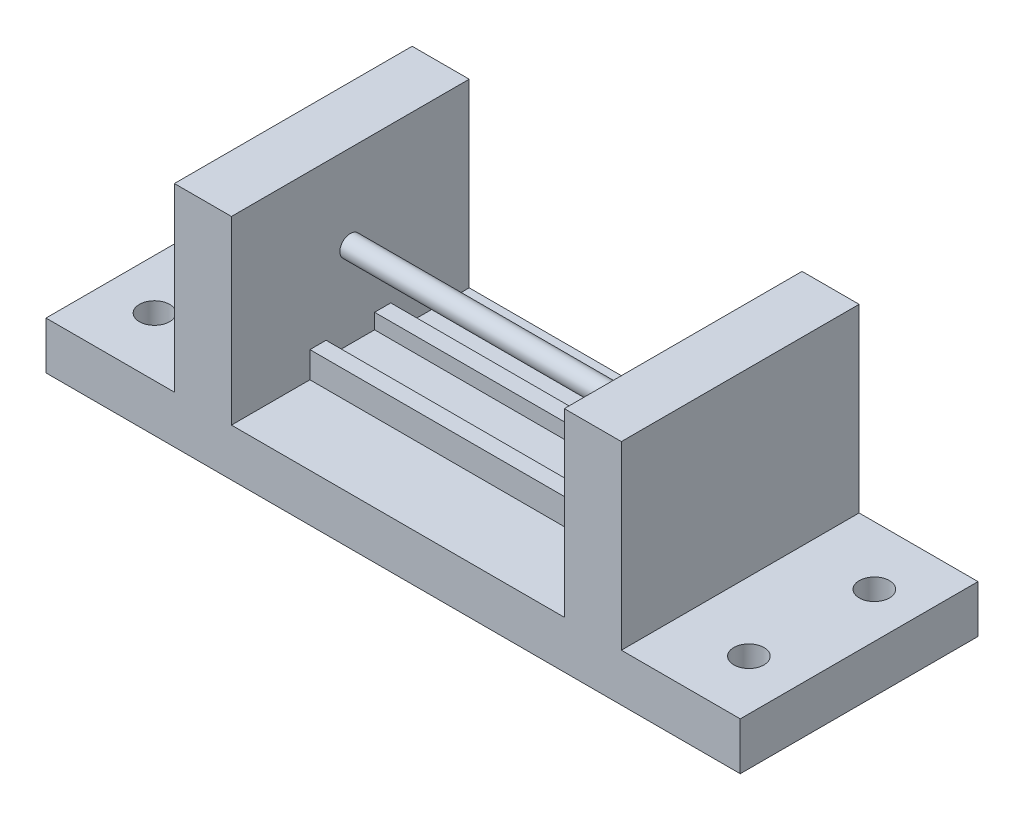
ISO-10303-21;
HEADER;
FILE_DESCRIPTION(('STEP AP214'),'2;1');
FILE_NAME('part.step','',(''),(''),'','','');
FILE_SCHEMA(('AUTOMOTIVE_DESIGN { 1 0 10303 214 1 1 1 1 }'));
ENDSEC;
DATA;
#1=APPLICATION_CONTEXT('core data for automotive mechanical design processes');
#2=APPLICATION_PROTOCOL_DEFINITION('international standard','automotive_design',2000,#1);
#3=PRODUCT_CONTEXT('',#1,'mechanical');
#4=PRODUCT('Part','Part','',(#3));
#5=PRODUCT_RELATED_PRODUCT_CATEGORY('part','',(#4));
#6=PRODUCT_DEFINITION_FORMATION('','',#4);
#7=PRODUCT_DEFINITION_CONTEXT('part definition',#1,'design');
#8=PRODUCT_DEFINITION('design','',#6,#7);
#9=PRODUCT_DEFINITION_SHAPE('','',#8);
#10=(LENGTH_UNIT() NAMED_UNIT(*) SI_UNIT(.MILLI.,.METRE.));
#11=(NAMED_UNIT(*) PLANE_ANGLE_UNIT() SI_UNIT($,.RADIAN.));
#12=(NAMED_UNIT(*) SI_UNIT($,.STERADIAN.) SOLID_ANGLE_UNIT());
#13=UNCERTAINTY_MEASURE_WITH_UNIT(LENGTH_MEASURE(1.E-05),#10,'distance_accuracy_value','');
#14=(GEOMETRIC_REPRESENTATION_CONTEXT(3) GLOBAL_UNCERTAINTY_ASSIGNED_CONTEXT((#13)) GLOBAL_UNIT_ASSIGNED_CONTEXT((#10,
#11,#12)) REPRESENTATION_CONTEXT('',''));
#15=CARTESIAN_POINT('',(0.,0.,0.));
#16=DIRECTION('',(0.,0.,1.));
#17=DIRECTION('',(1.,0.,0.));
#18=AXIS2_PLACEMENT_3D('',#15,#16,#17);
#19=CARTESIAN_POINT('',(0.,15.5,0.));
#20=DIRECTION('',(0.,-1.,0.));
#21=DIRECTION('',(0.,0.,-1.));
#22=AXIS2_PLACEMENT_3D('',#19,#20,#21);
#23=PLANE('',#22);
#24=DIRECTION('',(0.,0.,1.));
#25=VECTOR('',#24,1.);
#26=CARTESIAN_POINT('',(39.,15.5,33.5));
#27=LINE('',#26,#25);
#28=CARTESIAN_POINT('',(39.,15.5,16.5));
#29=VERTEX_POINT('',#28);
#30=CARTESIAN_POINT('',(39.,15.5,19.9));
#31=VERTEX_POINT('',#30);
#32=EDGE_CURVE('E210',#29,#31,#27,.T.);
#33=ORIENTED_EDGE('',*,*,#32,.T.);
#34=DIRECTION('',(-1.,0.,0.));
#35=VECTOR('',#34,1.);
#36=CARTESIAN_POINT('',(39.,15.5,19.9));
#37=LINE('',#36,#35);
#38=CARTESIAN_POINT('',(109.,15.5,19.9));
#39=VERTEX_POINT('',#38);
#40=EDGE_CURVE('E49',#39,#31,#37,.T.);
#41=ORIENTED_EDGE('',*,*,#40,.F.);
#42=DIRECTION('',(0.,0.,-1.));
#43=VECTOR('',#42,1.);
#44=CARTESIAN_POINT('',(109.,15.5,16.5));
#45=LINE('',#44,#43);
#46=CARTESIAN_POINT('',(109.,15.5,16.5));
#47=VERTEX_POINT('',#46);
#48=EDGE_CURVE('E56',#39,#47,#45,.T.);
#49=ORIENTED_EDGE('',*,*,#48,.T.);
#50=DIRECTION('',(-1.,0.,0.));
#51=VECTOR('',#50,1.);
#52=CARTESIAN_POINT('',(39.,15.5,16.5));
#53=LINE('',#52,#51);
#54=EDGE_CURVE('E206',#47,#29,#53,.T.);
#55=ORIENTED_EDGE('',*,*,#54,.T.);
#56=EDGE_LOOP('',(#33,#41,#49,#55));
#57=FACE_BOUND('',#56,.T.);
#58=ADVANCED_FACE('F34',(#57),#23,.F.);
#59=CARTESIAN_POINT('',(0.,10.,0.));
#60=DIRECTION('',(0.,1.,0.));
#61=DIRECTION('',(0.,0.,1.));
#62=AXIS2_PLACEMENT_3D('',#59,#60,#61);
#63=PLANE('',#62);
#64=DIRECTION('',(0.,0.,-1.));
#65=VECTOR('',#64,1.);
#66=CARTESIAN_POINT('',(39.,10.,0.));
#67=LINE('',#66,#65);
#68=CARTESIAN_POINT('',(39.,10.,16.5));
#69=VERTEX_POINT('',#68);
#70=CARTESIAN_POINT('',(39.,10.,0.));
#71=VERTEX_POINT('',#70);
#72=EDGE_CURVE('E252',#69,#71,#67,.T.);
#73=ORIENTED_EDGE('',*,*,#72,.F.);
#74=DIRECTION('',(-1.,0.,0.));
#75=VECTOR('',#74,1.);
#76=CARTESIAN_POINT('',(39.,10.,16.5));
#77=LINE('',#76,#75);
#78=CARTESIAN_POINT('',(109.,10.,16.5));
#79=VERTEX_POINT('',#78);
#80=EDGE_CURVE('E202',#79,#69,#77,.T.);
#81=ORIENTED_EDGE('',*,*,#80,.F.);
#82=DIRECTION('',(0.,0.,1.));
#83=VECTOR('',#82,1.);
#84=CARTESIAN_POINT('',(109.,10.,0.));
#85=LINE('',#84,#83);
#86=CARTESIAN_POINT('',(109.,10.,0.));
#87=VERTEX_POINT('',#86);
#88=EDGE_CURVE('E271',#87,#79,#85,.T.);
#89=ORIENTED_EDGE('',*,*,#88,.F.);
#90=DIRECTION('',(-1.,0.,0.));
#91=VECTOR('',#90,1.);
#92=CARTESIAN_POINT('',(0.,10.,0.));
#93=LINE('',#92,#91);
#94=EDGE_CURVE('E333',#87,#71,#93,.T.);
#95=ORIENTED_EDGE('',*,*,#94,.T.);
#96=EDGE_LOOP('',(#73,#81,#89,#95));
#97=FACE_BOUND('',#96,.T.);
#98=ADVANCED_FACE('F373',(#97),#63,.T.);
#99=CARTESIAN_POINT('',(109.,10.,33.5));
#100=VERTEX_POINT('',#99);
#101=CARTESIAN_POINT('',(109.,10.,50.));
#102=VERTEX_POINT('',#101);
#103=EDGE_CURVE('E280',#100,#102,#85,.T.);
#104=ORIENTED_EDGE('',*,*,#103,.F.);
#105=DIRECTION('',(1.,0.,0.));
#106=VECTOR('',#105,1.);
#107=CARTESIAN_POINT('',(109.,10.,33.5));
#108=LINE('',#107,#106);
#109=CARTESIAN_POINT('',(39.,10.,33.5));
#110=VERTEX_POINT('',#109);
#111=EDGE_CURVE('E209',#110,#100,#108,.T.);
#112=ORIENTED_EDGE('',*,*,#111,.F.);
#113=CARTESIAN_POINT('',(39.,10.,50.));
#114=VERTEX_POINT('',#113);
#115=EDGE_CURVE('E243',#114,#110,#67,.T.);
#116=ORIENTED_EDGE('',*,*,#115,.F.);
#117=DIRECTION('',(1.,0.,0.));
#118=VECTOR('',#117,1.);
#119=CARTESIAN_POINT('',(0.,10.,50.));
#120=LINE('',#119,#118);
#121=EDGE_CURVE('E327',#114,#102,#120,.T.);
#122=ORIENTED_EDGE('',*,*,#121,.T.);
#123=EDGE_LOOP('',(#104,#112,#116,#122));
#124=FACE_BOUND('',#123,.T.);
#125=ADVANCED_FACE('F402',(#124),#63,.T.);
#126=CARTESIAN_POINT('',(109.,48.,0.));
#127=DIRECTION('',(1.,0.,0.));
#128=DIRECTION('',(0.,0.,-1.));
#129=AXIS2_PLACEMENT_3D('',#126,#127,#128);
#130=PLANE('',#129);
#131=CARTESIAN_POINT('',(109.,30.2,25.));
#132=DIRECTION('',(1.,0.,0.));
#133=DIRECTION('',(0.,0.,-1.));
#134=AXIS2_PLACEMENT_3D('',#131,#132,#133);
#135=CIRCLE('',#134,2.2);
#136=CARTESIAN_POINT('',(109.,30.2,22.8));
#137=VERTEX_POINT('',#136);
#138=EDGE_CURVE('E235',#137,#137,#135,.T.);
#139=ORIENTED_EDGE('',*,*,#138,.T.);
#140=EDGE_LOOP('',(#139));
#141=FACE_BOUND('',#140,.T.);
#142=DIRECTION('',(0.,-1.,0.));
#143=VECTOR('',#142,1.);
#144=CARTESIAN_POINT('',(109.,15.5,16.5));
#145=LINE('',#144,#143);
#146=EDGE_CURVE('E218',#47,#79,#145,.T.);
#147=ORIENTED_EDGE('',*,*,#146,.F.);
#148=ORIENTED_EDGE('',*,*,#48,.F.);
#149=DIRECTION('',(0.,1.,0.));
#150=VECTOR('',#149,1.);
#151=CARTESIAN_POINT('',(109.,12.3,19.9));
#152=LINE('',#151,#150);
#153=CARTESIAN_POINT('',(109.,12.3,19.9));
#154=VERTEX_POINT('',#153);
#155=EDGE_CURVE('E200',#154,#39,#152,.T.);
#156=ORIENTED_EDGE('',*,*,#155,.F.);
#157=DIRECTION('',(0.,0.,-1.));
#158=VECTOR('',#157,1.);
#159=CARTESIAN_POINT('',(109.,12.3,19.9));
#160=LINE('',#159,#158);
#161=CARTESIAN_POINT('',(109.,12.3,30.0999999999999));
#162=VERTEX_POINT('',#161);
#163=EDGE_CURVE('E179',#162,#154,#160,.T.);
#164=ORIENTED_EDGE('',*,*,#163,.F.);
#165=DIRECTION('',(0.,1.,0.));
#166=VECTOR('',#165,1.);
#167=CARTESIAN_POINT('',(109.,12.3,30.0999999999999));
#168=LINE('',#167,#166);
#169=CARTESIAN_POINT('',(109.,15.5,30.0999999999999));
#170=VERTEX_POINT('',#169);
#171=EDGE_CURVE('E203',#162,#170,#168,.T.);
#172=ORIENTED_EDGE('',*,*,#171,.T.);
#173=CARTESIAN_POINT('',(109.,15.5,33.5));
#174=VERTEX_POINT('',#173);
#175=EDGE_CURVE('E215',#174,#170,#45,.T.);
#176=ORIENTED_EDGE('',*,*,#175,.F.);
#177=DIRECTION('',(0.,-1.,0.));
#178=VECTOR('',#177,1.);
#179=CARTESIAN_POINT('',(109.,15.5,33.5));
#180=LINE('',#179,#178);
#181=EDGE_CURVE('E225',#174,#100,#180,.T.);
#182=ORIENTED_EDGE('',*,*,#181,.T.);
#183=ORIENTED_EDGE('',*,*,#103,.T.);
#184=DIRECTION('',(0.,-1.,0.));
#185=VECTOR('',#184,1.);
#186=CARTESIAN_POINT('',(109.,48.,50.));
#187=LINE('',#186,#185);
#188=CARTESIAN_POINT('',(109.,48.,50.));
#189=VERTEX_POINT('',#188);
#190=EDGE_CURVE('E285',#189,#102,#187,.T.);
#191=ORIENTED_EDGE('',*,*,#190,.F.);
#192=DIRECTION('',(0.,0.,1.));
#193=VECTOR('',#192,1.);
#194=CARTESIAN_POINT('',(109.,48.,0.));
#195=LINE('',#194,#193);
#196=CARTESIAN_POINT('',(109.,48.,0.));
#197=VERTEX_POINT('',#196);
#198=EDGE_CURVE('E273',#197,#189,#195,.T.);
#199=ORIENTED_EDGE('',*,*,#198,.F.);
#200=DIRECTION('',(0.,-1.,0.));
#201=VECTOR('',#200,1.);
#202=CARTESIAN_POINT('',(109.,48.,0.));
#203=LINE('',#202,#201);
#204=EDGE_CURVE('E288',#197,#87,#203,.T.);
#205=ORIENTED_EDGE('',*,*,#204,.T.);
#206=ORIENTED_EDGE('',*,*,#88,.T.);
#207=EDGE_LOOP('',(#147,#148,#156,#164,#172,#176,#182,#183,#191,#199,#205,#206));
#208=FACE_BOUND('',#207,.T.);
#209=ADVANCED_FACE('F383',(#141,#208),#130,.F.);
#210=CARTESIAN_POINT('',(39.,48.,0.));
#211=DIRECTION('',(-1.,0.,0.));
#212=DIRECTION('',(0.,0.,1.));
#213=AXIS2_PLACEMENT_3D('',#210,#211,#212);
#214=PLANE('',#213);
#215=CARTESIAN_POINT('',(39.,30.2,25.));
#216=DIRECTION('',(-1.,0.,0.));
#217=DIRECTION('',(0.,0.,1.));
#218=AXIS2_PLACEMENT_3D('',#215,#216,#217);
#219=CIRCLE('',#218,2.2);
#220=CARTESIAN_POINT('',(39.,30.2,27.2));
#221=VERTEX_POINT('',#220);
#222=EDGE_CURVE('E232',#221,#221,#219,.F.);
#223=ORIENTED_EDGE('',*,*,#222,.F.);
#224=EDGE_LOOP('',(#223));
#225=FACE_BOUND('',#224,.T.);
#226=DIRECTION('',(0.,-1.,0.));
#227=VECTOR('',#226,1.);
#228=CARTESIAN_POINT('',(39.,15.5,16.5));
#229=LINE('',#228,#227);
#230=EDGE_CURVE('E230',#29,#69,#229,.T.);
#231=ORIENTED_EDGE('',*,*,#230,.T.);
#232=ORIENTED_EDGE('',*,*,#72,.T.);
#233=DIRECTION('',(0.,-1.,0.));
#234=VECTOR('',#233,1.);
#235=CARTESIAN_POINT('',(39.,48.,0.));
#236=LINE('',#235,#234);
#237=CARTESIAN_POINT('',(39.,48.,0.));
#238=VERTEX_POINT('',#237);
#239=EDGE_CURVE('E257',#238,#71,#236,.T.);
#240=ORIENTED_EDGE('',*,*,#239,.F.);
#241=DIRECTION('',(0.,0.,-1.));
#242=VECTOR('',#241,1.);
#243=CARTESIAN_POINT('',(39.,48.,0.));
#244=LINE('',#243,#242);
#245=CARTESIAN_POINT('',(39.,48.,50.));
#246=VERTEX_POINT('',#245);
#247=EDGE_CURVE('E245',#246,#238,#244,.T.);
#248=ORIENTED_EDGE('',*,*,#247,.F.);
#249=DIRECTION('',(0.,-1.,0.));
#250=VECTOR('',#249,1.);
#251=CARTESIAN_POINT('',(39.,48.,50.));
#252=LINE('',#251,#250);
#253=EDGE_CURVE('E260',#246,#114,#252,.T.);
#254=ORIENTED_EDGE('',*,*,#253,.T.);
#255=ORIENTED_EDGE('',*,*,#115,.T.);
#256=DIRECTION('',(0.,-1.,0.));
#257=VECTOR('',#256,1.);
#258=CARTESIAN_POINT('',(39.,15.5,33.5));
#259=LINE('',#258,#257);
#260=CARTESIAN_POINT('',(39.,15.5,33.5));
#261=VERTEX_POINT('',#260);
#262=EDGE_CURVE('E227',#261,#110,#259,.T.);
#263=ORIENTED_EDGE('',*,*,#262,.F.);
#264=CARTESIAN_POINT('',(39.,15.5,30.1));
#265=VERTEX_POINT('',#264);
#266=EDGE_CURVE('E208',#265,#261,#27,.T.);
#267=ORIENTED_EDGE('',*,*,#266,.F.);
#268=DIRECTION('',(0.,1.,0.));
#269=VECTOR('',#268,1.);
#270=CARTESIAN_POINT('',(39.,12.3,30.1));
#271=LINE('',#270,#269);
#272=CARTESIAN_POINT('',(39.,12.3,30.1));
#273=VERTEX_POINT('',#272);
#274=EDGE_CURVE('E178',#273,#265,#271,.T.);
#275=ORIENTED_EDGE('',*,*,#274,.F.);
#276=DIRECTION('',(0.,0.,1.));
#277=VECTOR('',#276,1.);
#278=CARTESIAN_POINT('',(39.,12.3,30.1));
#279=LINE('',#278,#277);
#280=CARTESIAN_POINT('',(39.,12.3,19.9));
#281=VERTEX_POINT('',#280);
#282=EDGE_CURVE('E182',#281,#273,#279,.T.);
#283=ORIENTED_EDGE('',*,*,#282,.F.);
#284=DIRECTION('',(0.,1.,0.));
#285=VECTOR('',#284,1.);
#286=CARTESIAN_POINT('',(39.,12.3,19.9));
#287=LINE('',#286,#285);
#288=EDGE_CURVE('E170',#281,#31,#287,.T.);
#289=ORIENTED_EDGE('',*,*,#288,.T.);
#290=ORIENTED_EDGE('',*,*,#32,.F.);
#291=EDGE_LOOP('',(#231,#232,#240,#248,#254,#255,#263,#267,#275,#283,#289,#290));
#292=FACE_BOUND('',#291,.T.);
#293=ADVANCED_FACE('F183',(#225,#292),#214,.F.);
#294=CARTESIAN_POINT('',(9.5,10.,12.3));
#295=DIRECTION('',(0.,1.,0.));
#296=DIRECTION('',(0.,0.,1.));
#297=AXIS2_PLACEMENT_3D('',#294,#295,#296);
#298=CIRCLE('',#297,3.175);
#299=CARTESIAN_POINT('',(9.5,10.,15.475));
#300=VERTEX_POINT('',#299);
#301=EDGE_CURVE('E311',#300,#300,#298,.T.);
#302=ORIENTED_EDGE('',*,*,#301,.F.);
#303=EDGE_LOOP('',(#302));
#304=FACE_BOUND('',#303,.T.);
#305=CARTESIAN_POINT('',(10.5,10.,37.6803073267445));
#306=DIRECTION('',(0.,1.,0.));
#307=DIRECTION('',(0.,0.,1.));
#308=AXIS2_PLACEMENT_3D('',#305,#306,#307);
#309=CIRCLE('',#308,3.175);
#310=CARTESIAN_POINT('',(10.5,10.,40.8553073267445));
#311=VERTEX_POINT('',#310);
#312=EDGE_CURVE('E298',#311,#311,#309,.T.);
#313=ORIENTED_EDGE('',*,*,#312,.F.);
#314=EDGE_LOOP('',(#313));
#315=FACE_BOUND('',#314,.T.);
#316=CARTESIAN_POINT('',(0.,10.,50.));
#317=VERTEX_POINT('',#316);
#318=CARTESIAN_POINT('',(27.,10.,50.));
#319=VERTEX_POINT('',#318);
#320=EDGE_CURVE('E324',#317,#319,#120,.T.);
#321=ORIENTED_EDGE('',*,*,#320,.T.);
#322=DIRECTION('',(0.,0.,1.));
#323=VECTOR('',#322,1.);
#324=CARTESIAN_POINT('',(27.,10.,0.));
#325=LINE('',#324,#323);
#326=CARTESIAN_POINT('',(27.,10.,0.));
#327=VERTEX_POINT('',#326);
#328=EDGE_CURVE('E238',#327,#319,#325,.T.);
#329=ORIENTED_EDGE('',*,*,#328,.F.);
#330=CARTESIAN_POINT('',(0.,10.,0.));
#331=VERTEX_POINT('',#330);
#332=EDGE_CURVE('E329',#327,#331,#93,.T.);
#333=ORIENTED_EDGE('',*,*,#332,.T.);
#334=DIRECTION('',(0.,0.,1.));
#335=VECTOR('',#334,1.);
#336=CARTESIAN_POINT('',(0.,10.,0.));
#337=LINE('',#336,#335);
#338=EDGE_CURVE('E319',#331,#317,#337,.T.);
#339=ORIENTED_EDGE('',*,*,#338,.T.);
#340=EDGE_LOOP('',(#321,#329,#333,#339));
#341=FACE_BOUND('',#340,.T.);
#342=ADVANCED_FACE('F366',(#304,#315,#341),#63,.T.);
#343=DIRECTION('',(0.,0.,-1.));
#344=VECTOR('',#343,1.);
#345=CARTESIAN_POINT('',(121.,10.,0.));
#346=LINE('',#345,#344);
#347=CARTESIAN_POINT('',(121.,10.,50.));
#348=VERTEX_POINT('',#347);
#349=CARTESIAN_POINT('',(121.,10.,0.));
#350=VERTEX_POINT('',#349);
#351=EDGE_CURVE('E266',#348,#350,#346,.T.);
#352=ORIENTED_EDGE('',*,*,#351,.F.);
#353=CARTESIAN_POINT('',(146.,10.,50.));
#354=VERTEX_POINT('',#353);
#355=EDGE_CURVE('E322',#348,#354,#120,.T.);
#356=ORIENTED_EDGE('',*,*,#355,.T.);
#357=DIRECTION('',(0.,0.,-1.));
#358=VECTOR('',#357,1.);
#359=CARTESIAN_POINT('',(146.,10.,0.));
#360=LINE('',#359,#358);
#361=CARTESIAN_POINT('',(146.,10.,0.));
#362=VERTEX_POINT('',#361);
#363=EDGE_CURVE('E326',#354,#362,#360,.T.);
#364=ORIENTED_EDGE('',*,*,#363,.T.);
#365=EDGE_CURVE('E330',#362,#350,#93,.T.);
#366=ORIENTED_EDGE('',*,*,#365,.T.);
#367=EDGE_LOOP('',(#352,#356,#364,#366));
#368=FACE_BOUND('',#367,.T.);
#369=CARTESIAN_POINT('',(135.5,10.,37.6803073267445));
#370=DIRECTION('',(0.,-1.,0.));
#371=DIRECTION('',(0.,0.,1.));
#372=AXIS2_PLACEMENT_3D('',#369,#370,#371);
#373=CIRCLE('',#372,3.175);
#374=CARTESIAN_POINT('',(135.5,10.,40.8553073267445));
#375=VERTEX_POINT('',#374);
#376=EDGE_CURVE('E294',#375,#375,#373,.T.);
#377=ORIENTED_EDGE('',*,*,#376,.T.);
#378=EDGE_LOOP('',(#377));
#379=FACE_BOUND('',#378,.T.);
#380=CARTESIAN_POINT('',(136.5,10.,12.3));
#381=DIRECTION('',(0.,-1.,0.));
#382=DIRECTION('',(0.,0.,1.));
#383=AXIS2_PLACEMENT_3D('',#380,#381,#382);
#384=CIRCLE('',#383,3.175);
#385=CARTESIAN_POINT('',(136.5,10.,15.475));
#386=VERTEX_POINT('',#385);
#387=EDGE_CURVE('E299',#386,#386,#384,.T.);
#388=ORIENTED_EDGE('',*,*,#387,.T.);
#389=EDGE_LOOP('',(#388));
#390=FACE_BOUND('',#389,.T.);
#391=ADVANCED_FACE('F395',(#368,#379,#390),#63,.T.);
#392=CARTESIAN_POINT('',(0.,10.,0.));
#393=DIRECTION('',(1.,0.,0.));
#394=DIRECTION('',(0.,0.,-1.));
#395=AXIS2_PLACEMENT_3D('',#392,#393,#394);
#396=PLANE('',#395);
#397=DIRECTION('',(0.,0.,1.));
#398=VECTOR('',#397,1.);
#399=CARTESIAN_POINT('',(0.,0.,0.));
#400=LINE('',#399,#398);
#401=CARTESIAN_POINT('',(0.,0.,0.));
#402=VERTEX_POINT('',#401);
#403=CARTESIAN_POINT('',(0.,0.,50.));
#404=VERTEX_POINT('',#403);
#405=EDGE_CURVE('E310',#402,#404,#400,.T.);
#406=ORIENTED_EDGE('',*,*,#405,.T.);
#407=DIRECTION('',(0.,-1.,0.));
#408=VECTOR('',#407,1.);
#409=CARTESIAN_POINT('',(0.,10.,50.));
#410=LINE('',#409,#408);
#411=EDGE_CURVE('E11',#317,#404,#410,.T.);
#412=ORIENTED_EDGE('',*,*,#411,.F.);
#413=ORIENTED_EDGE('',*,*,#338,.F.);
#414=DIRECTION('',(0.,-1.,0.));
#415=VECTOR('',#414,1.);
#416=CARTESIAN_POINT('',(0.,10.,0.));
#417=LINE('',#416,#415);
#418=EDGE_CURVE('E332',#331,#402,#417,.T.);
#419=ORIENTED_EDGE('',*,*,#418,.T.);
#420=EDGE_LOOP('',(#406,#412,#413,#419));
#421=FACE_BOUND('',#420,.T.);
#422=ADVANCED_FACE('F36',(#421),#396,.F.);
#423=CARTESIAN_POINT('',(0.,10.,50.));
#424=DIRECTION('',(0.,0.,-1.));
#425=DIRECTION('',(-1.,0.,0.));
#426=AXIS2_PLACEMENT_3D('',#423,#424,#425);
#427=PLANE('',#426);
#428=DIRECTION('',(1.,0.,0.));
#429=VECTOR('',#428,1.);
#430=CARTESIAN_POINT('',(0.,0.,50.));
#431=LINE('',#430,#429);
#432=CARTESIAN_POINT('',(146.,0.,50.));
#433=VERTEX_POINT('',#432);
#434=EDGE_CURVE('E336',#404,#433,#431,.T.);
#435=ORIENTED_EDGE('',*,*,#434,.T.);
#436=DIRECTION('',(0.,-1.,0.));
#437=VECTOR('',#436,1.);
#438=CARTESIAN_POINT('',(146.,10.,50.));
#439=LINE('',#438,#437);
#440=EDGE_CURVE('E42',#354,#433,#439,.T.);
#441=ORIENTED_EDGE('',*,*,#440,.F.);
#442=ORIENTED_EDGE('',*,*,#355,.F.);
#443=DIRECTION('',(0.,-1.,0.));
#444=VECTOR('',#443,1.);
#445=CARTESIAN_POINT('',(121.,48.,50.));
#446=LINE('',#445,#444);
#447=CARTESIAN_POINT('',(121.,48.,50.));
#448=VERTEX_POINT('',#447);
#449=EDGE_CURVE('E277',#448,#348,#446,.T.);
#450=ORIENTED_EDGE('',*,*,#449,.F.);
#451=DIRECTION('',(1.,0.,0.));
#452=VECTOR('',#451,1.);
#453=CARTESIAN_POINT('',(121.,48.,50.));
#454=LINE('',#453,#452);
#455=EDGE_CURVE('E275',#189,#448,#454,.T.);
#456=ORIENTED_EDGE('',*,*,#455,.F.);
#457=ORIENTED_EDGE('',*,*,#190,.T.);
#458=ORIENTED_EDGE('',*,*,#121,.F.);
#459=ORIENTED_EDGE('',*,*,#253,.F.);
#460=DIRECTION('',(1.,0.,0.));
#461=VECTOR('',#460,1.);
#462=CARTESIAN_POINT('',(27.,48.,50.));
#463=LINE('',#462,#461);
#464=CARTESIAN_POINT('',(27.,48.,50.));
#465=VERTEX_POINT('',#464);
#466=EDGE_CURVE('E242',#465,#246,#463,.T.);
#467=ORIENTED_EDGE('',*,*,#466,.F.);
#468=DIRECTION('',(0.,-1.,0.));
#469=VECTOR('',#468,1.);
#470=CARTESIAN_POINT('',(27.,48.,50.));
#471=LINE('',#470,#469);
#472=EDGE_CURVE('E263',#465,#319,#471,.T.);
#473=ORIENTED_EDGE('',*,*,#472,.T.);
#474=ORIENTED_EDGE('',*,*,#320,.F.);
#475=ORIENTED_EDGE('',*,*,#411,.T.);
#476=EDGE_LOOP('',(#435,#441,#442,#450,#456,#457,#458,#459,#467,#473,#474,#475));
#477=FACE_BOUND('',#476,.T.);
#478=ADVANCED_FACE('F397',(#477),#427,.F.);
#479=CARTESIAN_POINT('',(146.,10.,0.));
#480=DIRECTION('',(-1.,0.,0.));
#481=DIRECTION('',(0.,0.,1.));
#482=AXIS2_PLACEMENT_3D('',#479,#480,#481);
#483=PLANE('',#482);
#484=DIRECTION('',(0.,0.,-1.));
#485=VECTOR('',#484,1.);
#486=CARTESIAN_POINT('',(146.,0.,0.));
#487=LINE('',#486,#485);
#488=CARTESIAN_POINT('',(146.,0.,0.));
#489=VERTEX_POINT('',#488);
#490=EDGE_CURVE('E338',#433,#489,#487,.T.);
#491=ORIENTED_EDGE('',*,*,#490,.T.);
#492=DIRECTION('',(0.,-1.,0.));
#493=VECTOR('',#492,1.);
#494=CARTESIAN_POINT('',(146.,10.,0.));
#495=LINE('',#494,#493);
#496=EDGE_CURVE('E343',#362,#489,#495,.T.);
#497=ORIENTED_EDGE('',*,*,#496,.F.);
#498=ORIENTED_EDGE('',*,*,#363,.F.);
#499=ORIENTED_EDGE('',*,*,#440,.T.);
#500=EDGE_LOOP('',(#491,#497,#498,#499));
#501=FACE_BOUND('',#500,.T.);
#502=ADVANCED_FACE('F350',(#501),#483,.F.);
#503=CARTESIAN_POINT('',(0.,10.,0.));
#504=DIRECTION('',(0.,0.,1.));
#505=DIRECTION('',(1.,0.,0.));
#506=AXIS2_PLACEMENT_3D('',#503,#504,#505);
#507=PLANE('',#506);
#508=DIRECTION('',(-1.,0.,0.));
#509=VECTOR('',#508,1.);
#510=CARTESIAN_POINT('',(0.,0.,0.));
#511=LINE('',#510,#509);
#512=EDGE_CURVE('E323',#489,#402,#511,.T.);
#513=ORIENTED_EDGE('',*,*,#512,.T.);
#514=ORIENTED_EDGE('',*,*,#418,.F.);
#515=ORIENTED_EDGE('',*,*,#332,.F.);
#516=DIRECTION('',(0.,-1.,0.));
#517=VECTOR('',#516,1.);
#518=CARTESIAN_POINT('',(27.,48.,0.));
#519=LINE('',#518,#517);
#520=CARTESIAN_POINT('',(27.,48.,0.));
#521=VERTEX_POINT('',#520);
#522=EDGE_CURVE('E249',#521,#327,#519,.T.);
#523=ORIENTED_EDGE('',*,*,#522,.F.);
#524=DIRECTION('',(-1.,0.,0.));
#525=VECTOR('',#524,1.);
#526=CARTESIAN_POINT('',(27.,48.,0.));
#527=LINE('',#526,#525);
#528=EDGE_CURVE('E247',#238,#521,#527,.T.);
#529=ORIENTED_EDGE('',*,*,#528,.F.);
#530=ORIENTED_EDGE('',*,*,#239,.T.);
#531=ORIENTED_EDGE('',*,*,#94,.F.);
#532=ORIENTED_EDGE('',*,*,#204,.F.);
#533=DIRECTION('',(-1.,0.,0.));
#534=VECTOR('',#533,1.);
#535=CARTESIAN_POINT('',(121.,48.,0.));
#536=LINE('',#535,#534);
#537=CARTESIAN_POINT('',(121.,48.,0.));
#538=VERTEX_POINT('',#537);
#539=EDGE_CURVE('E270',#538,#197,#536,.T.);
#540=ORIENTED_EDGE('',*,*,#539,.F.);
#541=DIRECTION('',(0.,-1.,0.));
#542=VECTOR('',#541,1.);
#543=CARTESIAN_POINT('',(121.,48.,0.));
#544=LINE('',#543,#542);
#545=EDGE_CURVE('E291',#538,#350,#544,.T.);
#546=ORIENTED_EDGE('',*,*,#545,.T.);
#547=ORIENTED_EDGE('',*,*,#365,.F.);
#548=ORIENTED_EDGE('',*,*,#496,.T.);
#549=EDGE_LOOP('',(#513,#514,#515,#523,#529,#530,#531,#532,#540,#546,#547,#548));
#550=FACE_BOUND('',#549,.T.);
#551=ADVANCED_FACE('F360',(#550),#507,.F.);
#552=CARTESIAN_POINT('',(0.,0.,0.));
#553=DIRECTION('',(0.,1.,0.));
#554=DIRECTION('',(0.,0.,1.));
#555=AXIS2_PLACEMENT_3D('',#552,#553,#554);
#556=PLANE('',#555);
#557=CARTESIAN_POINT('',(136.5,0.,12.3));
#558=DIRECTION('',(0.,-1.,0.));
#559=DIRECTION('',(0.,0.,1.));
#560=AXIS2_PLACEMENT_3D('',#557,#558,#559);
#561=CIRCLE('',#560,3.175);
#562=CARTESIAN_POINT('',(136.5,0.,15.475));
#563=VERTEX_POINT('',#562);
#564=EDGE_CURVE('E295',#563,#563,#561,.T.);
#565=ORIENTED_EDGE('',*,*,#564,.F.);
#566=EDGE_LOOP('',(#565));
#567=FACE_BOUND('',#566,.T.);
#568=CARTESIAN_POINT('',(135.5,0.,37.6803073267445));
#569=DIRECTION('',(0.,-1.,0.));
#570=DIRECTION('',(0.,0.,1.));
#571=AXIS2_PLACEMENT_3D('',#568,#569,#570);
#572=CIRCLE('',#571,3.175);
#573=CARTESIAN_POINT('',(135.5,0.,40.8553073267445));
#574=VERTEX_POINT('',#573);
#575=EDGE_CURVE('E302',#574,#574,#572,.T.);
#576=ORIENTED_EDGE('',*,*,#575,.F.);
#577=EDGE_LOOP('',(#576));
#578=FACE_BOUND('',#577,.T.);
#579=CARTESIAN_POINT('',(9.5,0.,12.3));
#580=DIRECTION('',(0.,1.,0.));
#581=DIRECTION('',(0.,0.,1.));
#582=AXIS2_PLACEMENT_3D('',#579,#580,#581);
#583=CIRCLE('',#582,3.175);
#584=CARTESIAN_POINT('',(9.5,0.,15.475));
#585=VERTEX_POINT('',#584);
#586=EDGE_CURVE('E307',#585,#585,#583,.T.);
#587=ORIENTED_EDGE('',*,*,#586,.T.);
#588=EDGE_LOOP('',(#587));
#589=FACE_BOUND('',#588,.T.);
#590=CARTESIAN_POINT('',(10.5,0.,37.6803073267445));
#591=DIRECTION('',(0.,1.,0.));
#592=DIRECTION('',(0.,0.,1.));
#593=AXIS2_PLACEMENT_3D('',#590,#591,#592);
#594=CIRCLE('',#593,3.175);
#595=CARTESIAN_POINT('',(10.5,0.,40.8553073267445));
#596=VERTEX_POINT('',#595);
#597=EDGE_CURVE('E314',#596,#596,#594,.T.);
#598=ORIENTED_EDGE('',*,*,#597,.T.);
#599=EDGE_LOOP('',(#598));
#600=FACE_BOUND('',#599,.T.);
#601=ORIENTED_EDGE('',*,*,#405,.F.);
#602=ORIENTED_EDGE('',*,*,#512,.F.);
#603=ORIENTED_EDGE('',*,*,#490,.F.);
#604=ORIENTED_EDGE('',*,*,#434,.F.);
#605=EDGE_LOOP('',(#601,#602,#603,#604));
#606=FACE_BOUND('',#605,.T.);
#607=ADVANCED_FACE('F357',(#567,#578,#589,#600,#606),#556,.F.);
#608=CARTESIAN_POINT('',(10.5,0.,37.6803073267445));
#609=DIRECTION('',(0.,1.,0.));
#610=DIRECTION('',(0.,0.,1.));
#611=AXIS2_PLACEMENT_3D('',#608,#609,#610);
#612=CYLINDRICAL_SURFACE('',#611,3.175);
#613=ORIENTED_EDGE('',*,*,#597,.F.);
#614=EDGE_LOOP('',(#613));
#615=FACE_BOUND('',#614,.T.);
#616=ORIENTED_EDGE('',*,*,#312,.T.);
#617=EDGE_LOOP('',(#616));
#618=FACE_BOUND('',#617,.T.);
#619=ADVANCED_FACE('F614',(#615,#618),#612,.F.);
#620=CARTESIAN_POINT('',(9.5,0.,12.3));
#621=DIRECTION('',(0.,1.,0.));
#622=DIRECTION('',(0.,0.,1.));
#623=AXIS2_PLACEMENT_3D('',#620,#621,#622);
#624=CYLINDRICAL_SURFACE('',#623,3.175);
#625=ORIENTED_EDGE('',*,*,#586,.F.);
#626=EDGE_LOOP('',(#625));
#627=FACE_BOUND('',#626,.T.);
#628=ORIENTED_EDGE('',*,*,#301,.T.);
#629=EDGE_LOOP('',(#628));
#630=FACE_BOUND('',#629,.T.);
#631=ADVANCED_FACE('F603',(#627,#630),#624,.F.);
#632=CARTESIAN_POINT('',(135.5,0.,37.6803073267445));
#633=DIRECTION('',(0.,1.,0.));
#634=DIRECTION('',(0.,0.,1.));
#635=AXIS2_PLACEMENT_3D('',#632,#633,#634);
#636=CYLINDRICAL_SURFACE('',#635,3.175);
#637=ORIENTED_EDGE('',*,*,#575,.T.);
#638=EDGE_LOOP('',(#637));
#639=FACE_BOUND('',#638,.T.);
#640=ORIENTED_EDGE('',*,*,#376,.F.);
#641=EDGE_LOOP('',(#640));
#642=FACE_BOUND('',#641,.T.);
#643=ADVANCED_FACE('F593',(#639,#642),#636,.F.);
#644=CARTESIAN_POINT('',(136.5,0.,12.3));
#645=DIRECTION('',(0.,1.,0.));
#646=DIRECTION('',(0.,0.,1.));
#647=AXIS2_PLACEMENT_3D('',#644,#645,#646);
#648=CYLINDRICAL_SURFACE('',#647,3.175);
#649=ORIENTED_EDGE('',*,*,#564,.T.);
#650=EDGE_LOOP('',(#649));
#651=FACE_BOUND('',#650,.T.);
#652=ORIENTED_EDGE('',*,*,#387,.F.);
#653=EDGE_LOOP('',(#652));
#654=FACE_BOUND('',#653,.T.);
#655=ADVANCED_FACE('F535',(#651,#654),#648,.F.);
#656=CARTESIAN_POINT('',(121.,48.,0.));
#657=DIRECTION('',(-1.,0.,0.));
#658=DIRECTION('',(0.,0.,1.));
#659=AXIS2_PLACEMENT_3D('',#656,#657,#658);
#660=PLANE('',#659);
#661=ORIENTED_EDGE('',*,*,#351,.T.);
#662=ORIENTED_EDGE('',*,*,#545,.F.);
#663=DIRECTION('',(0.,0.,-1.));
#664=VECTOR('',#663,1.);
#665=CARTESIAN_POINT('',(121.,48.,0.));
#666=LINE('',#665,#664);
#667=EDGE_CURVE('E267',#448,#538,#666,.T.);
#668=ORIENTED_EDGE('',*,*,#667,.F.);
#669=ORIENTED_EDGE('',*,*,#449,.T.);
#670=EDGE_LOOP('',(#661,#662,#668,#669));
#671=FACE_BOUND('',#670,.T.);
#672=ADVANCED_FACE('F393',(#671),#660,.F.);
#673=CARTESIAN_POINT('',(0.,48.,0.));
#674=DIRECTION('',(0.,-1.,0.));
#675=DIRECTION('',(0.,0.,-1.));
#676=AXIS2_PLACEMENT_3D('',#673,#674,#675);
#677=PLANE('',#676);
#678=ORIENTED_EDGE('',*,*,#667,.T.);
#679=ORIENTED_EDGE('',*,*,#539,.T.);
#680=ORIENTED_EDGE('',*,*,#198,.T.);
#681=ORIENTED_EDGE('',*,*,#455,.T.);
#682=EDGE_LOOP('',(#678,#679,#680,#681));
#683=FACE_BOUND('',#682,.T.);
#684=ADVANCED_FACE('F389',(#683),#677,.F.);
#685=CARTESIAN_POINT('',(27.,48.,0.));
#686=DIRECTION('',(1.,0.,0.));
#687=DIRECTION('',(0.,0.,-1.));
#688=AXIS2_PLACEMENT_3D('',#685,#686,#687);
#689=PLANE('',#688);
#690=ORIENTED_EDGE('',*,*,#328,.T.);
#691=ORIENTED_EDGE('',*,*,#472,.F.);
#692=DIRECTION('',(0.,0.,1.));
#693=VECTOR('',#692,1.);
#694=CARTESIAN_POINT('',(27.,48.,0.));
#695=LINE('',#694,#693);
#696=EDGE_CURVE('E239',#521,#465,#695,.T.);
#697=ORIENTED_EDGE('',*,*,#696,.F.);
#698=ORIENTED_EDGE('',*,*,#522,.T.);
#699=EDGE_LOOP('',(#690,#691,#697,#698));
#700=FACE_BOUND('',#699,.T.);
#701=ADVANCED_FACE('F414',(#700),#689,.F.);
#702=CARTESIAN_POINT('',(0.,48.,0.));
#703=DIRECTION('',(0.,1.,0.));
#704=DIRECTION('',(0.,0.,1.));
#705=AXIS2_PLACEMENT_3D('',#702,#703,#704);
#706=PLANE('',#705);
#707=ORIENTED_EDGE('',*,*,#696,.T.);
#708=ORIENTED_EDGE('',*,*,#466,.T.);
#709=ORIENTED_EDGE('',*,*,#247,.T.);
#710=ORIENTED_EDGE('',*,*,#528,.T.);
#711=EDGE_LOOP('',(#707,#708,#709,#710));
#712=FACE_BOUND('',#711,.T.);
#713=ADVANCED_FACE('F412',(#712),#706,.T.);
#714=CARTESIAN_POINT('',(32.7774603255584,30.2,25.));
#715=DIRECTION('',(1.,0.,0.));
#716=DIRECTION('',(0.,0.,-1.));
#717=AXIS2_PLACEMENT_3D('',#714,#715,#716);
#718=CYLINDRICAL_SURFACE('',#717,2.2);
#719=ORIENTED_EDGE('',*,*,#222,.T.);
#720=EDGE_LOOP('',(#719));
#721=FACE_BOUND('',#720,.T.);
#722=ORIENTED_EDGE('',*,*,#138,.F.);
#723=EDGE_LOOP('',(#722));
#724=FACE_BOUND('',#723,.T.);
#725=ADVANCED_FACE('F421',(#721,#724),#718,.T.);
#726=CARTESIAN_POINT('',(39.,15.5,16.5));
#727=DIRECTION('',(0.,0.,1.));
#728=DIRECTION('',(1.,0.,0.));
#729=AXIS2_PLACEMENT_3D('',#726,#727,#728);
#730=PLANE('',#729);
#731=ORIENTED_EDGE('',*,*,#80,.T.);
#732=ORIENTED_EDGE('',*,*,#230,.F.);
#733=ORIENTED_EDGE('',*,*,#54,.F.);
#734=ORIENTED_EDGE('',*,*,#146,.T.);
#735=EDGE_LOOP('',(#731,#732,#733,#734));
#736=FACE_BOUND('',#735,.T.);
#737=ADVANCED_FACE('F381',(#736),#730,.F.);
#738=CARTESIAN_POINT('',(109.,15.5,33.5));
#739=DIRECTION('',(0.,0.,-1.));
#740=DIRECTION('',(-1.,0.,0.));
#741=AXIS2_PLACEMENT_3D('',#738,#739,#740);
#742=PLANE('',#741);
#743=ORIENTED_EDGE('',*,*,#111,.T.);
#744=ORIENTED_EDGE('',*,*,#181,.F.);
#745=DIRECTION('',(1.,0.,0.));
#746=VECTOR('',#745,1.);
#747=CARTESIAN_POINT('',(109.,15.5,33.5));
#748=LINE('',#747,#746);
#749=EDGE_CURVE('E212',#261,#174,#748,.T.);
#750=ORIENTED_EDGE('',*,*,#749,.F.);
#751=ORIENTED_EDGE('',*,*,#262,.T.);
#752=EDGE_LOOP('',(#743,#744,#750,#751));
#753=FACE_BOUND('',#752,.T.);
#754=ADVANCED_FACE('F407',(#753),#742,.F.);
#755=ORIENTED_EDGE('',*,*,#175,.T.);
#756=DIRECTION('',(1.,0.,0.));
#757=VECTOR('',#756,1.);
#758=CARTESIAN_POINT('',(109.,15.5,30.0999999999999));
#759=LINE('',#758,#757);
#760=EDGE_CURVE('E192',#265,#170,#759,.T.);
#761=ORIENTED_EDGE('',*,*,#760,.F.);
#762=ORIENTED_EDGE('',*,*,#266,.T.);
#763=ORIENTED_EDGE('',*,*,#749,.T.);
#764=EDGE_LOOP('',(#755,#761,#762,#763));
#765=FACE_BOUND('',#764,.T.);
#766=ADVANCED_FACE('F427',(#765),#23,.F.);
#767=CARTESIAN_POINT('',(39.,12.3,19.9));
#768=DIRECTION('',(0.,0.,-1.));
#769=DIRECTION('',(-1.,0.,0.));
#770=AXIS2_PLACEMENT_3D('',#767,#768,#769);
#771=PLANE('',#770);
#772=ORIENTED_EDGE('',*,*,#40,.T.);
#773=ORIENTED_EDGE('',*,*,#288,.F.);
#774=DIRECTION('',(-1.,0.,0.));
#775=VECTOR('',#774,1.);
#776=CARTESIAN_POINT('',(39.,12.3,19.9));
#777=LINE('',#776,#775);
#778=EDGE_CURVE('E174',#154,#281,#777,.T.);
#779=ORIENTED_EDGE('',*,*,#778,.F.);
#780=ORIENTED_EDGE('',*,*,#155,.T.);
#781=EDGE_LOOP('',(#772,#773,#779,#780));
#782=FACE_BOUND('',#781,.T.);
#783=ADVANCED_FACE('F172',(#782),#771,.F.);
#784=CARTESIAN_POINT('',(109.,12.3,30.0999999999999));
#785=DIRECTION('',(0.,0.,1.));
#786=DIRECTION('',(1.,0.,0.));
#787=AXIS2_PLACEMENT_3D('',#784,#785,#786);
#788=PLANE('',#787);
#789=ORIENTED_EDGE('',*,*,#760,.T.);
#790=ORIENTED_EDGE('',*,*,#171,.F.);
#791=DIRECTION('',(1.,0.,0.));
#792=VECTOR('',#791,1.);
#793=CARTESIAN_POINT('',(109.,12.3,30.0999999999999));
#794=LINE('',#793,#792);
#795=EDGE_CURVE('E188',#273,#162,#794,.T.);
#796=ORIENTED_EDGE('',*,*,#795,.F.);
#797=ORIENTED_EDGE('',*,*,#274,.T.);
#798=EDGE_LOOP('',(#789,#790,#796,#797));
#799=FACE_BOUND('',#798,.T.);
#800=ADVANCED_FACE('F440',(#799),#788,.F.);
#801=CARTESIAN_POINT('',(0.,12.3,0.));
#802=DIRECTION('',(0.,-1.,0.));
#803=DIRECTION('',(0.,0.,-1.));
#804=AXIS2_PLACEMENT_3D('',#801,#802,#803);
#805=PLANE('',#804);
#806=ORIENTED_EDGE('',*,*,#778,.T.);
#807=ORIENTED_EDGE('',*,*,#282,.T.);
#808=ORIENTED_EDGE('',*,*,#795,.T.);
#809=ORIENTED_EDGE('',*,*,#163,.T.);
#810=EDGE_LOOP('',(#806,#807,#808,#809));
#811=FACE_BOUND('',#810,.T.);
#812=ADVANCED_FACE('F190',(#811),#805,.F.);
#813=CLOSED_SHELL('',(#58,#98,#125,#209,#293,#342,#391,#422,#478,#502,#551,#607,#619,#631,#643,
#655,#672,#684,#701,#713,#725,#737,#754,#766,#783,#800,#812));
#814=MANIFOLD_SOLID_BREP('B2',#813);
#815=ADVANCED_BREP_SHAPE_REPRESENTATION('',(#18,#814),#14);
#816=SHAPE_DEFINITION_REPRESENTATION(#9,#815);
ENDSEC;
END-ISO-10303-21;
